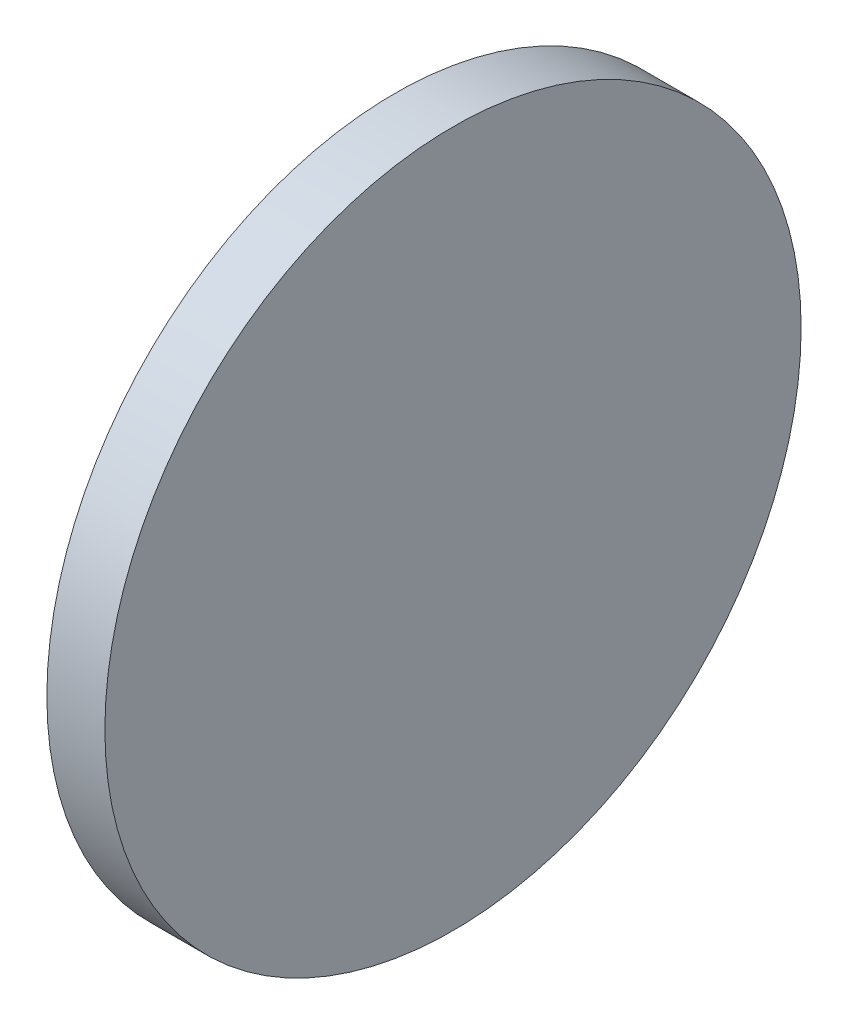
ISO-10303-21;
HEADER;
FILE_DESCRIPTION(('STEP AP214'),'2;1');
FILE_NAME('part.step','',(''),(''),'','','');
FILE_SCHEMA(('AUTOMOTIVE_DESIGN { 1 0 10303 214 1 1 1 1 }'));
ENDSEC;
DATA;
#1=APPLICATION_CONTEXT('core data for automotive mechanical design processes');
#2=APPLICATION_PROTOCOL_DEFINITION('international standard','automotive_design',2000,#1);
#3=PRODUCT_CONTEXT('',#1,'mechanical');
#4=PRODUCT('Part','Part','',(#3));
#5=PRODUCT_RELATED_PRODUCT_CATEGORY('part','',(#4));
#6=PRODUCT_DEFINITION_FORMATION('','',#4);
#7=PRODUCT_DEFINITION_CONTEXT('part definition',#1,'design');
#8=PRODUCT_DEFINITION('design','',#6,#7);
#9=PRODUCT_DEFINITION_SHAPE('','',#8);
#10=(LENGTH_UNIT() NAMED_UNIT(*) SI_UNIT(.MILLI.,.METRE.));
#11=(NAMED_UNIT(*) PLANE_ANGLE_UNIT() SI_UNIT($,.RADIAN.));
#12=(NAMED_UNIT(*) SI_UNIT($,.STERADIAN.) SOLID_ANGLE_UNIT());
#13=UNCERTAINTY_MEASURE_WITH_UNIT(LENGTH_MEASURE(1.E-05),#10,'distance_accuracy_value','');
#14=(GEOMETRIC_REPRESENTATION_CONTEXT(3) GLOBAL_UNCERTAINTY_ASSIGNED_CONTEXT((#13)) GLOBAL_UNIT_ASSIGNED_CONTEXT((#10,
#11,#12)) REPRESENTATION_CONTEXT('',''));
#15=CARTESIAN_POINT('',(0.,0.,0.));
#16=DIRECTION('',(0.,0.,1.));
#17=DIRECTION('',(1.,0.,0.));
#18=AXIS2_PLACEMENT_3D('',#15,#16,#17);
#19=CARTESIAN_POINT('',(1.5875,0.,0.));
#20=DIRECTION('',(-1.,0.,0.));
#21=DIRECTION('',(0.,0.,1.));
#22=AXIS2_PLACEMENT_3D('',#19,#20,#21);
#23=CYLINDRICAL_SURFACE('',#22,9.525);
#24=CARTESIAN_POINT('',(1.5875,0.,0.));
#25=DIRECTION('',(1.,0.,0.));
#26=DIRECTION('',(0.,0.,-1.));
#27=AXIS2_PLACEMENT_3D('',#24,#25,#26);
#28=CIRCLE('',#27,9.525);
#29=CARTESIAN_POINT('',(1.5875,0.,-9.525));
#30=VERTEX_POINT('',#29);
#31=EDGE_CURVE('E10',#30,#30,#28,.T.);
#32=ORIENTED_EDGE('',*,*,#31,.F.);
#33=EDGE_LOOP('',(#32));
#34=FACE_BOUND('',#33,.T.);
#35=CARTESIAN_POINT('',(0.,0.,0.));
#36=DIRECTION('',(1.,0.,0.));
#37=DIRECTION('',(0.,0.,-1.));
#38=AXIS2_PLACEMENT_3D('',#35,#36,#37);
#39=CIRCLE('',#38,9.525);
#40=CARTESIAN_POINT('',(0.,0.,-9.525));
#41=VERTEX_POINT('',#40);
#42=EDGE_CURVE('E364',#41,#41,#39,.T.);
#43=ORIENTED_EDGE('',*,*,#42,.T.);
#44=EDGE_LOOP('',(#43));
#45=FACE_BOUND('',#44,.T.);
#46=ADVANCED_FACE('F358',(#34,#45),#23,.T.);
#47=CARTESIAN_POINT('',(1.5875,0.,0.));
#48=DIRECTION('',(1.,0.,0.));
#49=DIRECTION('',(0.,0.,-1.));
#50=AXIS2_PLACEMENT_3D('',#47,#48,#49);
#51=PLANE('',#50);
#52=ORIENTED_EDGE('',*,*,#31,.T.);
#53=EDGE_LOOP('',(#52));
#54=FACE_BOUND('',#53,.T.);
#55=ADVANCED_FACE('F373',(#54),#51,.T.);
#56=CARTESIAN_POINT('',(0.,0.,0.));
#57=DIRECTION('',(1.,0.,0.));
#58=DIRECTION('',(0.,0.,-1.));
#59=AXIS2_PLACEMENT_3D('',#56,#57,#58);
#60=PLANE('',#59);
#61=ORIENTED_EDGE('',*,*,#42,.F.);
#62=EDGE_LOOP('',(#61));
#63=FACE_BOUND('',#62,.T.);
#64=ADVANCED_FACE('F371',(#63),#60,.F.);
#65=CLOSED_SHELL('',(#46,#55,#64));
#66=MANIFOLD_SOLID_BREP('B2',#65);
#67=ADVANCED_BREP_SHAPE_REPRESENTATION('',(#18,#66),#14);
#68=SHAPE_DEFINITION_REPRESENTATION(#9,#67);
ENDSEC;
END-ISO-10303-21;
